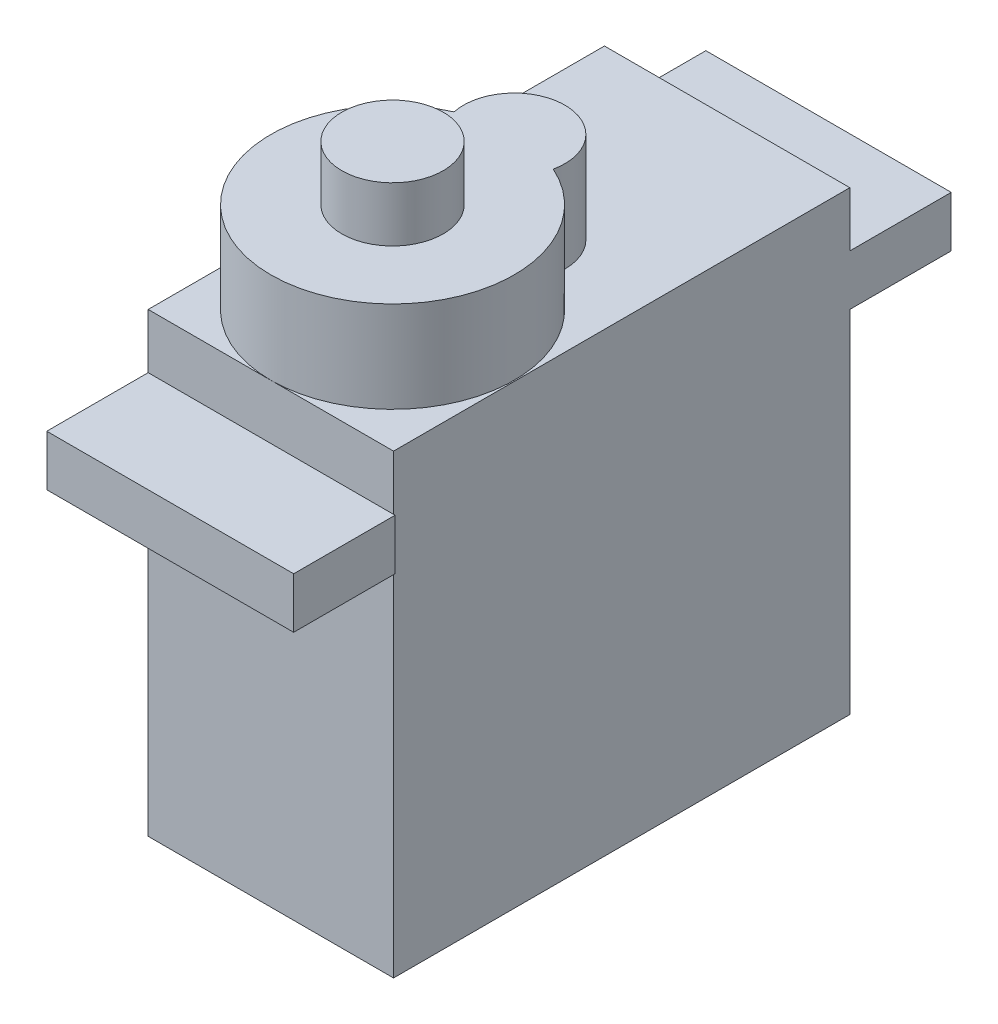
ISO-10303-21;
HEADER;
FILE_DESCRIPTION(('STEP AP214'),'2;1');
FILE_NAME('part.step','',(''),(''),'','','');
FILE_SCHEMA(('AUTOMOTIVE_DESIGN { 1 0 10303 214 1 1 1 1 }'));
ENDSEC;
DATA;
#1=APPLICATION_CONTEXT('core data for automotive mechanical design processes');
#2=APPLICATION_PROTOCOL_DEFINITION('international standard','automotive_design',2000,#1);
#3=PRODUCT_CONTEXT('',#1,'mechanical');
#4=PRODUCT('Part','Part','',(#3));
#5=PRODUCT_RELATED_PRODUCT_CATEGORY('part','',(#4));
#6=PRODUCT_DEFINITION_FORMATION('','',#4);
#7=PRODUCT_DEFINITION_CONTEXT('part definition',#1,'design');
#8=PRODUCT_DEFINITION('design','',#6,#7);
#9=PRODUCT_DEFINITION_SHAPE('','',#8);
#10=(LENGTH_UNIT() NAMED_UNIT(*) SI_UNIT(.MILLI.,.METRE.));
#11=(NAMED_UNIT(*) PLANE_ANGLE_UNIT() SI_UNIT($,.RADIAN.));
#12=(NAMED_UNIT(*) SI_UNIT($,.STERADIAN.) SOLID_ANGLE_UNIT());
#13=UNCERTAINTY_MEASURE_WITH_UNIT(LENGTH_MEASURE(1.E-05),#10,'distance_accuracy_value','');
#14=(GEOMETRIC_REPRESENTATION_CONTEXT(3) GLOBAL_UNCERTAINTY_ASSIGNED_CONTEXT((#13)) GLOBAL_UNIT_ASSIGNED_CONTEXT((#10,
#11,#12)) REPRESENTATION_CONTEXT('',''));
#15=CARTESIAN_POINT('',(0.,0.,0.));
#16=DIRECTION('',(0.,0.,1.));
#17=DIRECTION('',(1.,0.,0.));
#18=AXIS2_PLACEMENT_3D('',#15,#16,#17);
#19=CARTESIAN_POINT('',(6.05,22.5,-11.25));
#20=DIRECTION('',(-1.,0.,0.));
#21=DIRECTION('',(0.,0.,1.));
#22=AXIS2_PLACEMENT_3D('',#19,#20,#21);
#23=PLANE('',#22);
#24=DIRECTION('',(0.,0.,-1.));
#25=VECTOR('',#24,1.);
#26=CARTESIAN_POINT('',(6.05,0.,-11.25));
#27=LINE('',#26,#25);
#28=CARTESIAN_POINT('',(6.05,0.,11.25));
#29=VERTEX_POINT('',#28);
#30=CARTESIAN_POINT('',(6.05,0.,-11.25));
#31=VERTEX_POINT('',#30);
#32=EDGE_CURVE('E203',#29,#31,#27,.T.);
#33=ORIENTED_EDGE('',*,*,#32,.T.);
#34=DIRECTION('',(0.,-1.,0.));
#35=VECTOR('',#34,1.);
#36=CARTESIAN_POINT('',(6.05,17.3,-11.25));
#37=LINE('',#36,#35);
#38=CARTESIAN_POINT('',(6.05,17.3,-11.25));
#39=VERTEX_POINT('',#38);
#40=EDGE_CURVE('E298',#39,#31,#37,.T.);
#41=ORIENTED_EDGE('',*,*,#40,.F.);
#42=DIRECTION('',(0.,0.,1.));
#43=VECTOR('',#42,1.);
#44=CARTESIAN_POINT('',(6.05,17.3,-11.25));
#45=LINE('',#44,#43);
#46=CARTESIAN_POINT('',(6.05,17.3,-16.25));
#47=VERTEX_POINT('',#46);
#48=EDGE_CURVE('E294',#47,#39,#45,.T.);
#49=ORIENTED_EDGE('',*,*,#48,.F.);
#50=DIRECTION('',(0.,-1.,0.));
#51=VECTOR('',#50,1.);
#52=CARTESIAN_POINT('',(6.05,19.8,-16.25));
#53=LINE('',#52,#51);
#54=CARTESIAN_POINT('',(6.05,19.8,-16.25));
#55=VERTEX_POINT('',#54);
#56=EDGE_CURVE('E241',#55,#47,#53,.T.);
#57=ORIENTED_EDGE('',*,*,#56,.F.);
#58=DIRECTION('',(0.,0.,1.));
#59=VECTOR('',#58,1.);
#60=CARTESIAN_POINT('',(6.05,19.8,-11.25));
#61=LINE('',#60,#59);
#62=CARTESIAN_POINT('',(6.05,19.8,-11.25));
#63=VERTEX_POINT('',#62);
#64=EDGE_CURVE('E238',#55,#63,#61,.T.);
#65=ORIENTED_EDGE('',*,*,#64,.T.);
#66=DIRECTION('',(0.,-1.,0.));
#67=VECTOR('',#66,1.);
#68=CARTESIAN_POINT('',(6.05,22.5,-11.25));
#69=LINE('',#68,#67);
#70=CARTESIAN_POINT('',(6.05,22.5,-11.25));
#71=VERTEX_POINT('',#70);
#72=EDGE_CURVE('E47',#71,#63,#69,.T.);
#73=ORIENTED_EDGE('',*,*,#72,.F.);
#74=DIRECTION('',(0.,0.,-1.));
#75=VECTOR('',#74,1.);
#76=CARTESIAN_POINT('',(6.05,22.5,-11.25));
#77=LINE('',#76,#75);
#78=CARTESIAN_POINT('',(6.05,22.5,11.25));
#79=VERTEX_POINT('',#78);
#80=EDGE_CURVE('E204',#79,#71,#77,.T.);
#81=ORIENTED_EDGE('',*,*,#80,.F.);
#82=DIRECTION('',(0.,-1.,0.));
#83=VECTOR('',#82,1.);
#84=CARTESIAN_POINT('',(6.05,22.5,11.25));
#85=LINE('',#84,#83);
#86=CARTESIAN_POINT('',(6.05,19.8,11.25));
#87=VERTEX_POINT('',#86);
#88=EDGE_CURVE('E216',#79,#87,#85,.T.);
#89=ORIENTED_EDGE('',*,*,#88,.T.);
#90=DIRECTION('',(0.,-1.,0.));
#91=VECTOR('',#90,1.);
#92=CARTESIAN_POINT('',(6.05,22.5,11.25));
#93=LINE('',#92,#91);
#94=CARTESIAN_POINT('',(6.05,17.3,11.25));
#95=VERTEX_POINT('',#94);
#96=EDGE_CURVE('E177',#87,#95,#93,.T.);
#97=ORIENTED_EDGE('',*,*,#96,.T.);
#98=DIRECTION('',(0.,-1.,0.));
#99=VECTOR('',#98,1.);
#100=CARTESIAN_POINT('',(6.05,22.5,11.25));
#101=LINE('',#100,#99);
#102=EDGE_CURVE('E289',#95,#29,#101,.T.);
#103=ORIENTED_EDGE('',*,*,#102,.T.);
#104=EDGE_LOOP('',(#33,#41,#49,#57,#65,#73,#81,#89,#97,#103));
#105=FACE_BOUND('',#104,.T.);
#106=ADVANCED_FACE('F39',(#105),#23,.F.);
#107=CARTESIAN_POINT('',(-6.05,22.5,-11.25));
#108=DIRECTION('',(0.,0.,1.));
#109=DIRECTION('',(1.,0.,0.));
#110=AXIS2_PLACEMENT_3D('',#107,#108,#109);
#111=PLANE('',#110);
#112=ORIENTED_EDGE('',*,*,#72,.T.);
#113=DIRECTION('',(-1.,0.,0.));
#114=VECTOR('',#113,1.);
#115=CARTESIAN_POINT('',(-6.05,19.8,-11.25));
#116=LINE('',#115,#114);
#117=CARTESIAN_POINT('',(-6.05,19.8,-11.25));
#118=VERTEX_POINT('',#117);
#119=EDGE_CURVE('E234',#63,#118,#116,.T.);
#120=ORIENTED_EDGE('',*,*,#119,.T.);
#121=DIRECTION('',(0.,-1.,0.));
#122=VECTOR('',#121,1.);
#123=CARTESIAN_POINT('',(-6.05,22.5,-11.25));
#124=LINE('',#123,#122);
#125=CARTESIAN_POINT('',(-6.05,22.5,-11.25));
#126=VERTEX_POINT('',#125);
#127=EDGE_CURVE('E225',#126,#118,#124,.T.);
#128=ORIENTED_EDGE('',*,*,#127,.F.);
#129=DIRECTION('',(-1.,0.,0.));
#130=VECTOR('',#129,1.);
#131=CARTESIAN_POINT('',(-6.05,22.5,-11.25));
#132=LINE('',#131,#130);
#133=EDGE_CURVE('E207',#71,#126,#132,.T.);
#134=ORIENTED_EDGE('',*,*,#133,.F.);
#135=EDGE_LOOP('',(#112,#120,#128,#134));
#136=FACE_BOUND('',#135,.T.);
#137=ADVANCED_FACE('F231',(#136),#111,.F.);
#138=CARTESIAN_POINT('',(-6.05,22.5,-11.25));
#139=DIRECTION('',(1.,0.,0.));
#140=DIRECTION('',(0.,0.,-1.));
#141=AXIS2_PLACEMENT_3D('',#138,#139,#140);
#142=PLANE('',#141);
#143=DIRECTION('',(0.,0.,1.));
#144=VECTOR('',#143,1.);
#145=CARTESIAN_POINT('',(-6.05,0.,-11.25));
#146=LINE('',#145,#144);
#147=CARTESIAN_POINT('',(-6.05,0.,-11.25));
#148=VERTEX_POINT('',#147);
#149=CARTESIAN_POINT('',(-6.05,0.,11.25));
#150=VERTEX_POINT('',#149);
#151=EDGE_CURVE('E208',#148,#150,#146,.T.);
#152=ORIENTED_EDGE('',*,*,#151,.T.);
#153=DIRECTION('',(0.,-1.,0.));
#154=VECTOR('',#153,1.);
#155=CARTESIAN_POINT('',(-6.05,17.3,11.25));
#156=LINE('',#155,#154);
#157=CARTESIAN_POINT('',(-6.05,17.3,11.25));
#158=VERTEX_POINT('',#157);
#159=EDGE_CURVE('E286',#158,#150,#156,.T.);
#160=ORIENTED_EDGE('',*,*,#159,.F.);
#161=DIRECTION('',(0.,0.,-1.));
#162=VECTOR('',#161,1.);
#163=CARTESIAN_POINT('',(-6.05,17.3,11.25));
#164=LINE('',#163,#162);
#165=CARTESIAN_POINT('',(-6.05,17.3,16.25));
#166=VERTEX_POINT('',#165);
#167=EDGE_CURVE('E169',#166,#158,#164,.T.);
#168=ORIENTED_EDGE('',*,*,#167,.F.);
#169=DIRECTION('',(0.,-1.,0.));
#170=VECTOR('',#169,1.);
#171=CARTESIAN_POINT('',(-6.05,19.8,16.25));
#172=LINE('',#171,#170);
#173=CARTESIAN_POINT('',(-6.05,19.8,16.25));
#174=VERTEX_POINT('',#173);
#175=EDGE_CURVE('E168',#174,#166,#172,.T.);
#176=ORIENTED_EDGE('',*,*,#175,.F.);
#177=DIRECTION('',(0.,0.,-1.));
#178=VECTOR('',#177,1.);
#179=CARTESIAN_POINT('',(-6.05,19.8,11.25));
#180=LINE('',#179,#178);
#181=CARTESIAN_POINT('',(-6.05,19.8,11.25));
#182=VERTEX_POINT('',#181);
#183=EDGE_CURVE('E179',#174,#182,#180,.T.);
#184=ORIENTED_EDGE('',*,*,#183,.T.);
#185=DIRECTION('',(0.,-1.,0.));
#186=VECTOR('',#185,1.);
#187=CARTESIAN_POINT('',(-6.05,22.5,11.25));
#188=LINE('',#187,#186);
#189=CARTESIAN_POINT('',(-6.05,22.5,11.25));
#190=VERTEX_POINT('',#189);
#191=EDGE_CURVE('E223',#190,#182,#188,.T.);
#192=ORIENTED_EDGE('',*,*,#191,.F.);
#193=DIRECTION('',(0.,0.,1.));
#194=VECTOR('',#193,1.);
#195=CARTESIAN_POINT('',(-6.05,22.5,-11.25));
#196=LINE('',#195,#194);
#197=EDGE_CURVE('E210',#126,#190,#196,.T.);
#198=ORIENTED_EDGE('',*,*,#197,.F.);
#199=ORIENTED_EDGE('',*,*,#127,.T.);
#200=DIRECTION('',(0.,0.,-1.));
#201=VECTOR('',#200,1.);
#202=CARTESIAN_POINT('',(-6.05,19.8,-16.25));
#203=LINE('',#202,#201);
#204=CARTESIAN_POINT('',(-6.05,19.8,-16.25));
#205=VERTEX_POINT('',#204);
#206=EDGE_CURVE('E249',#118,#205,#203,.T.);
#207=ORIENTED_EDGE('',*,*,#206,.T.);
#208=DIRECTION('',(0.,-1.,0.));
#209=VECTOR('',#208,1.);
#210=CARTESIAN_POINT('',(-6.05,19.8,-16.25));
#211=LINE('',#210,#209);
#212=CARTESIAN_POINT('',(-6.05,17.3,-16.25));
#213=VERTEX_POINT('',#212);
#214=EDGE_CURVE('E250',#205,#213,#211,.T.);
#215=ORIENTED_EDGE('',*,*,#214,.T.);
#216=DIRECTION('',(0.,0.,-1.));
#217=VECTOR('',#216,1.);
#218=CARTESIAN_POINT('',(-6.05,17.3,-16.25));
#219=LINE('',#218,#217);
#220=CARTESIAN_POINT('',(-6.05,17.3,-11.25));
#221=VERTEX_POINT('',#220);
#222=EDGE_CURVE('E64',#221,#213,#219,.T.);
#223=ORIENTED_EDGE('',*,*,#222,.F.);
#224=DIRECTION('',(0.,-1.,0.));
#225=VECTOR('',#224,1.);
#226=CARTESIAN_POINT('',(-6.05,17.3,-11.25));
#227=LINE('',#226,#225);
#228=EDGE_CURVE('E283',#221,#148,#227,.T.);
#229=ORIENTED_EDGE('',*,*,#228,.T.);
#230=EDGE_LOOP('',(#152,#160,#168,#176,#184,#192,#198,#199,#207,#215,#223,#229));
#231=FACE_BOUND('',#230,.T.);
#232=ADVANCED_FACE('F266',(#231),#142,.F.);
#233=CARTESIAN_POINT('',(-6.05,22.5,11.25));
#234=DIRECTION('',(0.,0.,-1.));
#235=DIRECTION('',(-1.,0.,0.));
#236=AXIS2_PLACEMENT_3D('',#233,#234,#235);
#237=PLANE('',#236);
#238=ORIENTED_EDGE('',*,*,#191,.T.);
#239=DIRECTION('',(1.,0.,0.));
#240=VECTOR('',#239,1.);
#241=CARTESIAN_POINT('',(6.125,19.8,11.25));
#242=LINE('',#241,#240);
#243=EDGE_CURVE('E258',#182,#87,#242,.T.);
#244=ORIENTED_EDGE('',*,*,#243,.T.);
#245=ORIENTED_EDGE('',*,*,#88,.F.);
#246=DIRECTION('',(1.,0.,0.));
#247=VECTOR('',#246,1.);
#248=CARTESIAN_POINT('',(-6.05,22.5,11.25));
#249=LINE('',#248,#247);
#250=CARTESIAN_POINT('',(0.,22.5,11.25));
#251=VERTEX_POINT('',#250);
#252=EDGE_CURVE('E212',#251,#79,#249,.T.);
#253=ORIENTED_EDGE('',*,*,#252,.F.);
#254=EDGE_CURVE('E213',#190,#251,#249,.T.);
#255=ORIENTED_EDGE('',*,*,#254,.F.);
#256=EDGE_LOOP('',(#238,#244,#245,#253,#255));
#257=FACE_BOUND('',#256,.T.);
#258=ADVANCED_FACE('F275',(#257),#237,.F.);
#259=CARTESIAN_POINT('',(0.,22.5,0.));
#260=DIRECTION('',(0.,1.,0.));
#261=DIRECTION('',(0.,0.,1.));
#262=AXIS2_PLACEMENT_3D('',#259,#260,#261);
#263=PLANE('',#262);
#264=CARTESIAN_POINT('',(0.,22.5,5.25));
#265=DIRECTION('',(0.,1.,0.));
#266=DIRECTION('',(0.,0.,1.));
#267=AXIS2_PLACEMENT_3D('',#264,#265,#266);
#268=CIRCLE('',#267,6.);
#269=CARTESIAN_POINT('',(-2.44514470714698,22.5,-0.229166666666664));
#270=VERTEX_POINT('',#269);
#271=EDGE_CURVE('E49',#270,#251,#268,.T.);
#272=ORIENTED_EDGE('',*,*,#271,.F.);
#273=CARTESIAN_POINT('',(0.,22.5,-0.749999999999998));
#274=DIRECTION('',(0.,1.,0.));
#275=DIRECTION('',(0.,0.,1.));
#276=AXIS2_PLACEMENT_3D('',#273,#274,#275);
#277=CIRCLE('',#276,2.5);
#278=CARTESIAN_POINT('',(2.44514470714698,22.5,-0.229166666666663));
#279=VERTEX_POINT('',#278);
#280=EDGE_CURVE('E192',#279,#270,#277,.T.);
#281=ORIENTED_EDGE('',*,*,#280,.F.);
#282=EDGE_CURVE('E11',#251,#279,#268,.T.);
#283=ORIENTED_EDGE('',*,*,#282,.F.);
#284=ORIENTED_EDGE('',*,*,#252,.T.);
#285=ORIENTED_EDGE('',*,*,#80,.T.);
#286=ORIENTED_EDGE('',*,*,#133,.T.);
#287=ORIENTED_EDGE('',*,*,#197,.T.);
#288=ORIENTED_EDGE('',*,*,#254,.T.);
#289=EDGE_LOOP('',(#272,#281,#283,#284,#285,#286,#287,#288));
#290=FACE_BOUND('',#289,.T.);
#291=ADVANCED_FACE('F307',(#290),#263,.T.);
#292=CARTESIAN_POINT('',(0.,0.,0.));
#293=DIRECTION('',(0.,1.,0.));
#294=DIRECTION('',(0.,0.,1.));
#295=AXIS2_PLACEMENT_3D('',#292,#293,#294);
#296=PLANE('',#295);
#297=ORIENTED_EDGE('',*,*,#32,.F.);
#298=DIRECTION('',(1.,0.,0.));
#299=VECTOR('',#298,1.);
#300=CARTESIAN_POINT('',(6.125,0.,11.25));
#301=LINE('',#300,#299);
#302=EDGE_CURVE('E281',#150,#29,#301,.T.);
#303=ORIENTED_EDGE('',*,*,#302,.F.);
#304=ORIENTED_EDGE('',*,*,#151,.F.);
#305=DIRECTION('',(-1.,0.,0.));
#306=VECTOR('',#305,1.);
#307=CARTESIAN_POINT('',(-6.05,0.,-11.25));
#308=LINE('',#307,#306);
#309=EDGE_CURVE('E292',#31,#148,#308,.T.);
#310=ORIENTED_EDGE('',*,*,#309,.F.);
#311=EDGE_LOOP('',(#297,#303,#304,#310));
#312=FACE_BOUND('',#311,.T.);
#313=ADVANCED_FACE('F343',(#312),#296,.F.);
#314=CARTESIAN_POINT('',(0.,27.,5.25));
#315=DIRECTION('',(0.,-1.,0.));
#316=DIRECTION('',(0.,0.,-1.));
#317=AXIS2_PLACEMENT_3D('',#314,#315,#316);
#318=CYLINDRICAL_SURFACE('',#317,6.);
#319=ORIENTED_EDGE('',*,*,#271,.T.);
#320=ORIENTED_EDGE('',*,*,#282,.T.);
#321=DIRECTION('',(0.,-1.,0.));
#322=VECTOR('',#321,1.);
#323=CARTESIAN_POINT('',(2.44514470714698,27.,-0.229166666666663));
#324=LINE('',#323,#322);
#325=CARTESIAN_POINT('',(2.44514470714698,27.,-0.229166666666663));
#326=VERTEX_POINT('',#325);
#327=EDGE_CURVE('E200',#326,#279,#324,.T.);
#328=ORIENTED_EDGE('',*,*,#327,.F.);
#329=CARTESIAN_POINT('',(0.,27.,5.25));
#330=DIRECTION('',(0.,1.,0.));
#331=DIRECTION('',(0.,0.,1.));
#332=AXIS2_PLACEMENT_3D('',#329,#330,#331);
#333=CIRCLE('',#332,6.);
#334=CARTESIAN_POINT('',(-2.44514470714698,27.,-0.229166666666664));
#335=VERTEX_POINT('',#334);
#336=EDGE_CURVE('E188',#335,#326,#333,.T.);
#337=ORIENTED_EDGE('',*,*,#336,.F.);
#338=DIRECTION('',(0.,-1.,0.));
#339=VECTOR('',#338,1.);
#340=CARTESIAN_POINT('',(-2.44514470714698,27.,-0.229166666666664));
#341=LINE('',#340,#339);
#342=EDGE_CURVE('E193',#335,#270,#341,.T.);
#343=ORIENTED_EDGE('',*,*,#342,.T.);
#344=EDGE_LOOP('',(#319,#320,#328,#337,#343));
#345=FACE_BOUND('',#344,.T.);
#346=ADVANCED_FACE('F310',(#345),#318,.T.);
#347=CARTESIAN_POINT('',(0.,27.,-0.749999999999998));
#348=DIRECTION('',(0.,-1.,0.));
#349=DIRECTION('',(0.,0.,-1.));
#350=AXIS2_PLACEMENT_3D('',#347,#348,#349);
#351=CYLINDRICAL_SURFACE('',#350,2.5);
#352=ORIENTED_EDGE('',*,*,#280,.T.);
#353=ORIENTED_EDGE('',*,*,#342,.F.);
#354=CARTESIAN_POINT('',(0.,27.,-0.749999999999998));
#355=DIRECTION('',(0.,1.,0.));
#356=DIRECTION('',(0.,0.,1.));
#357=AXIS2_PLACEMENT_3D('',#354,#355,#356);
#358=CIRCLE('',#357,2.5);
#359=EDGE_CURVE('E191',#326,#335,#358,.T.);
#360=ORIENTED_EDGE('',*,*,#359,.F.);
#361=ORIENTED_EDGE('',*,*,#327,.T.);
#362=EDGE_LOOP('',(#352,#353,#360,#361));
#363=FACE_BOUND('',#362,.T.);
#364=ADVANCED_FACE('F313',(#363),#351,.T.);
#365=CARTESIAN_POINT('',(0.,27.,2.25));
#366=DIRECTION('',(0.,1.,0.));
#367=DIRECTION('',(0.,0.,1.));
#368=AXIS2_PLACEMENT_3D('',#365,#366,#367);
#369=PLANE('',#368);
#370=CARTESIAN_POINT('',(0.,27.,5.25));
#371=DIRECTION('',(0.,1.,0.));
#372=DIRECTION('',(0.,0.,1.));
#373=AXIS2_PLACEMENT_3D('',#370,#371,#372);
#374=CIRCLE('',#373,2.5);
#375=CARTESIAN_POINT('',(0.,27.,7.75));
#376=VERTEX_POINT('',#375);
#377=EDGE_CURVE('E42',#376,#376,#374,.F.);
#378=ORIENTED_EDGE('',*,*,#377,.T.);
#379=EDGE_LOOP('',(#378));
#380=FACE_BOUND('',#379,.T.);
#381=ORIENTED_EDGE('',*,*,#336,.T.);
#382=ORIENTED_EDGE('',*,*,#359,.T.);
#383=EDGE_LOOP('',(#381,#382));
#384=FACE_BOUND('',#383,.T.);
#385=ADVANCED_FACE('F316',(#380,#384),#369,.T.);
#386=CARTESIAN_POINT('',(0.,29.7,5.25));
#387=DIRECTION('',(0.,-1.,0.));
#388=DIRECTION('',(0.,0.,-1.));
#389=AXIS2_PLACEMENT_3D('',#386,#387,#388);
#390=CYLINDRICAL_SURFACE('',#389,2.5);
#391=ORIENTED_EDGE('',*,*,#377,.F.);
#392=EDGE_LOOP('',(#391));
#393=FACE_BOUND('',#392,.T.);
#394=CARTESIAN_POINT('',(0.,29.7,5.25));
#395=DIRECTION('',(0.,1.,0.));
#396=DIRECTION('',(0.,0.,1.));
#397=AXIS2_PLACEMENT_3D('',#394,#395,#396);
#398=CIRCLE('',#397,2.5);
#399=CARTESIAN_POINT('',(0.,29.7,7.75));
#400=VERTEX_POINT('',#399);
#401=EDGE_CURVE('E185',#400,#400,#398,.T.);
#402=ORIENTED_EDGE('',*,*,#401,.F.);
#403=EDGE_LOOP('',(#402));
#404=FACE_BOUND('',#403,.T.);
#405=ADVANCED_FACE('F318',(#393,#404),#390,.T.);
#406=CARTESIAN_POINT('',(0.,29.7,5.25));
#407=DIRECTION('',(0.,1.,0.));
#408=DIRECTION('',(0.,0.,1.));
#409=AXIS2_PLACEMENT_3D('',#406,#407,#408);
#410=PLANE('',#409);
#411=ORIENTED_EDGE('',*,*,#401,.T.);
#412=EDGE_LOOP('',(#411));
#413=FACE_BOUND('',#412,.T.);
#414=ADVANCED_FACE('F325',(#413),#410,.T.);
#415=CARTESIAN_POINT('',(6.125,19.8,11.25));
#416=DIRECTION('',(0.,0.,-1.));
#417=DIRECTION('',(-1.,0.,0.));
#418=AXIS2_PLACEMENT_3D('',#415,#416,#417);
#419=PLANE('',#418);
#420=DIRECTION('',(1.,0.,0.));
#421=VECTOR('',#420,1.);
#422=CARTESIAN_POINT('',(6.125,17.3,11.25));
#423=LINE('',#422,#421);
#424=CARTESIAN_POINT('',(6.125,17.3,11.25));
#425=VERTEX_POINT('',#424);
#426=EDGE_CURVE('E56',#95,#425,#423,.T.);
#427=ORIENTED_EDGE('',*,*,#426,.F.);
#428=ORIENTED_EDGE('',*,*,#96,.F.);
#429=CARTESIAN_POINT('',(6.125,19.8,11.25));
#430=VERTEX_POINT('',#429);
#431=EDGE_CURVE('E256',#87,#430,#242,.T.);
#432=ORIENTED_EDGE('',*,*,#431,.T.);
#433=DIRECTION('',(0.,-1.,0.));
#434=VECTOR('',#433,1.);
#435=CARTESIAN_POINT('',(6.125,19.8,11.25));
#436=LINE('',#435,#434);
#437=EDGE_CURVE('E175',#430,#425,#436,.T.);
#438=ORIENTED_EDGE('',*,*,#437,.T.);
#439=EDGE_LOOP('',(#427,#428,#432,#438));
#440=FACE_BOUND('',#439,.T.);
#441=ADVANCED_FACE('F280',(#440),#419,.T.);
#442=CARTESIAN_POINT('',(-6.05,19.8,16.25));
#443=DIRECTION('',(0.,0.,1.));
#444=DIRECTION('',(1.,0.,0.));
#445=AXIS2_PLACEMENT_3D('',#442,#443,#444);
#446=PLANE('',#445);
#447=DIRECTION('',(-1.,0.,0.));
#448=VECTOR('',#447,1.);
#449=CARTESIAN_POINT('',(-6.05,17.3,16.25));
#450=LINE('',#449,#448);
#451=CARTESIAN_POINT('',(6.125,17.3,16.25));
#452=VERTEX_POINT('',#451);
#453=EDGE_CURVE('E154',#452,#166,#450,.T.);
#454=ORIENTED_EDGE('',*,*,#453,.F.);
#455=DIRECTION('',(0.,-1.,0.));
#456=VECTOR('',#455,1.);
#457=CARTESIAN_POINT('',(6.125,19.8,16.25));
#458=LINE('',#457,#456);
#459=CARTESIAN_POINT('',(6.125,19.8,16.25));
#460=VERTEX_POINT('',#459);
#461=EDGE_CURVE('E166',#460,#452,#458,.T.);
#462=ORIENTED_EDGE('',*,*,#461,.F.);
#463=DIRECTION('',(-1.,0.,0.));
#464=VECTOR('',#463,1.);
#465=CARTESIAN_POINT('',(-6.05,19.8,16.25));
#466=LINE('',#465,#464);
#467=EDGE_CURVE('E261',#460,#174,#466,.T.);
#468=ORIENTED_EDGE('',*,*,#467,.T.);
#469=ORIENTED_EDGE('',*,*,#175,.T.);
#470=EDGE_LOOP('',(#454,#462,#468,#469));
#471=FACE_BOUND('',#470,.T.);
#472=ADVANCED_FACE('F164',(#471),#446,.T.);
#473=CARTESIAN_POINT('',(6.125,19.8,16.25));
#474=DIRECTION('',(1.,0.,0.));
#475=DIRECTION('',(0.,0.,-1.));
#476=AXIS2_PLACEMENT_3D('',#473,#474,#475);
#477=PLANE('',#476);
#478=DIRECTION('',(0.,0.,1.));
#479=VECTOR('',#478,1.);
#480=CARTESIAN_POINT('',(6.125,17.3,16.25));
#481=LINE('',#480,#479);
#482=EDGE_CURVE('E150',#425,#452,#481,.T.);
#483=ORIENTED_EDGE('',*,*,#482,.F.);
#484=ORIENTED_EDGE('',*,*,#437,.F.);
#485=DIRECTION('',(0.,0.,1.));
#486=VECTOR('',#485,1.);
#487=CARTESIAN_POINT('',(6.125,19.8,16.25));
#488=LINE('',#487,#486);
#489=EDGE_CURVE('E174',#430,#460,#488,.T.);
#490=ORIENTED_EDGE('',*,*,#489,.T.);
#491=ORIENTED_EDGE('',*,*,#461,.T.);
#492=EDGE_LOOP('',(#483,#484,#490,#491));
#493=FACE_BOUND('',#492,.T.);
#494=ADVANCED_FACE('F172',(#493),#477,.T.);
#495=CARTESIAN_POINT('',(0.,19.8,0.));
#496=DIRECTION('',(0.,1.,0.));
#497=DIRECTION('',(0.,0.,1.));
#498=AXIS2_PLACEMENT_3D('',#495,#496,#497);
#499=PLANE('',#498);
#500=ORIENTED_EDGE('',*,*,#243,.F.);
#501=ORIENTED_EDGE('',*,*,#183,.F.);
#502=ORIENTED_EDGE('',*,*,#467,.F.);
#503=ORIENTED_EDGE('',*,*,#489,.F.);
#504=ORIENTED_EDGE('',*,*,#431,.F.);
#505=EDGE_LOOP('',(#500,#501,#502,#503,#504));
#506=FACE_BOUND('',#505,.T.);
#507=ADVANCED_FACE('F271',(#506),#499,.T.);
#508=CARTESIAN_POINT('',(6.05,19.8,-16.25));
#509=DIRECTION('',(0.,0.,-1.));
#510=DIRECTION('',(-1.,0.,0.));
#511=AXIS2_PLACEMENT_3D('',#508,#509,#510);
#512=PLANE('',#511);
#513=DIRECTION('',(1.,0.,0.));
#514=VECTOR('',#513,1.);
#515=CARTESIAN_POINT('',(6.05,17.3,-16.25));
#516=LINE('',#515,#514);
#517=EDGE_CURVE('E291',#213,#47,#516,.T.);
#518=ORIENTED_EDGE('',*,*,#517,.F.);
#519=ORIENTED_EDGE('',*,*,#214,.F.);
#520=DIRECTION('',(1.,0.,0.));
#521=VECTOR('',#520,1.);
#522=CARTESIAN_POINT('',(6.05,19.8,-16.25));
#523=LINE('',#522,#521);
#524=EDGE_CURVE('E245',#205,#55,#523,.T.);
#525=ORIENTED_EDGE('',*,*,#524,.T.);
#526=ORIENTED_EDGE('',*,*,#56,.T.);
#527=EDGE_LOOP('',(#518,#519,#525,#526));
#528=FACE_BOUND('',#527,.T.);
#529=ADVANCED_FACE('F305',(#528),#512,.T.);
#530=CARTESIAN_POINT('',(0.,19.8,0.));
#531=DIRECTION('',(0.,1.,0.));
#532=DIRECTION('',(0.,0.,1.));
#533=AXIS2_PLACEMENT_3D('',#530,#531,#532);
#534=PLANE('',#533);
#535=ORIENTED_EDGE('',*,*,#206,.F.);
#536=ORIENTED_EDGE('',*,*,#119,.F.);
#537=ORIENTED_EDGE('',*,*,#64,.F.);
#538=ORIENTED_EDGE('',*,*,#524,.F.);
#539=EDGE_LOOP('',(#535,#536,#537,#538));
#540=FACE_BOUND('',#539,.T.);
#541=ADVANCED_FACE('F247',(#540),#534,.T.);
#542=CARTESIAN_POINT('',(-6.05,17.3,-11.25));
#543=DIRECTION('',(0.,0.,1.));
#544=DIRECTION('',(1.,0.,0.));
#545=AXIS2_PLACEMENT_3D('',#542,#543,#544);
#546=PLANE('',#545);
#547=ORIENTED_EDGE('',*,*,#309,.T.);
#548=ORIENTED_EDGE('',*,*,#228,.F.);
#549=DIRECTION('',(-1.,0.,0.));
#550=VECTOR('',#549,1.);
#551=CARTESIAN_POINT('',(-6.05,17.3,-11.25));
#552=LINE('',#551,#550);
#553=EDGE_CURVE('E296',#39,#221,#552,.T.);
#554=ORIENTED_EDGE('',*,*,#553,.F.);
#555=ORIENTED_EDGE('',*,*,#40,.T.);
#556=EDGE_LOOP('',(#547,#548,#554,#555));
#557=FACE_BOUND('',#556,.T.);
#558=ADVANCED_FACE('F433',(#557),#546,.F.);
#559=CARTESIAN_POINT('',(0.,17.3,0.));
#560=DIRECTION('',(0.,1.,0.));
#561=DIRECTION('',(0.,0.,1.));
#562=AXIS2_PLACEMENT_3D('',#559,#560,#561);
#563=PLANE('',#562);
#564=ORIENTED_EDGE('',*,*,#222,.T.);
#565=ORIENTED_EDGE('',*,*,#517,.T.);
#566=ORIENTED_EDGE('',*,*,#48,.T.);
#567=ORIENTED_EDGE('',*,*,#553,.T.);
#568=EDGE_LOOP('',(#564,#565,#566,#567));
#569=FACE_BOUND('',#568,.T.);
#570=ADVANCED_FACE('F439',(#569),#563,.F.);
#571=CARTESIAN_POINT('',(6.125,17.3,11.25));
#572=DIRECTION('',(0.,0.,-1.));
#573=DIRECTION('',(-1.,0.,0.));
#574=AXIS2_PLACEMENT_3D('',#571,#572,#573);
#575=PLANE('',#574);
#576=EDGE_CURVE('E160',#158,#95,#423,.T.);
#577=ORIENTED_EDGE('',*,*,#576,.F.);
#578=ORIENTED_EDGE('',*,*,#159,.T.);
#579=ORIENTED_EDGE('',*,*,#302,.T.);
#580=ORIENTED_EDGE('',*,*,#102,.F.);
#581=EDGE_LOOP('',(#577,#578,#579,#580));
#582=FACE_BOUND('',#581,.T.);
#583=ADVANCED_FACE('F447',(#582),#575,.F.);
#584=CARTESIAN_POINT('',(0.,17.3,0.));
#585=DIRECTION('',(0.,1.,0.));
#586=DIRECTION('',(0.,0.,1.));
#587=AXIS2_PLACEMENT_3D('',#584,#585,#586);
#588=PLANE('',#587);
#589=ORIENTED_EDGE('',*,*,#576,.T.);
#590=ORIENTED_EDGE('',*,*,#426,.T.);
#591=ORIENTED_EDGE('',*,*,#482,.T.);
#592=ORIENTED_EDGE('',*,*,#453,.T.);
#593=ORIENTED_EDGE('',*,*,#167,.T.);
#594=EDGE_LOOP('',(#589,#590,#591,#592,#593));
#595=FACE_BOUND('',#594,.T.);
#596=ADVANCED_FACE('F152',(#595),#588,.F.);
#597=CLOSED_SHELL('',(#106,#137,#232,#258,#291,#313,#346,#364,#385,#405,#414,#441,#472,#494,
#507,#529,#541,#558,#570,#583,#596));
#598=MANIFOLD_SOLID_BREP('B2',#597);
#599=ADVANCED_BREP_SHAPE_REPRESENTATION('',(#18,#598),#14);
#600=SHAPE_DEFINITION_REPRESENTATION(#9,#599);
ENDSEC;
END-ISO-10303-21;
